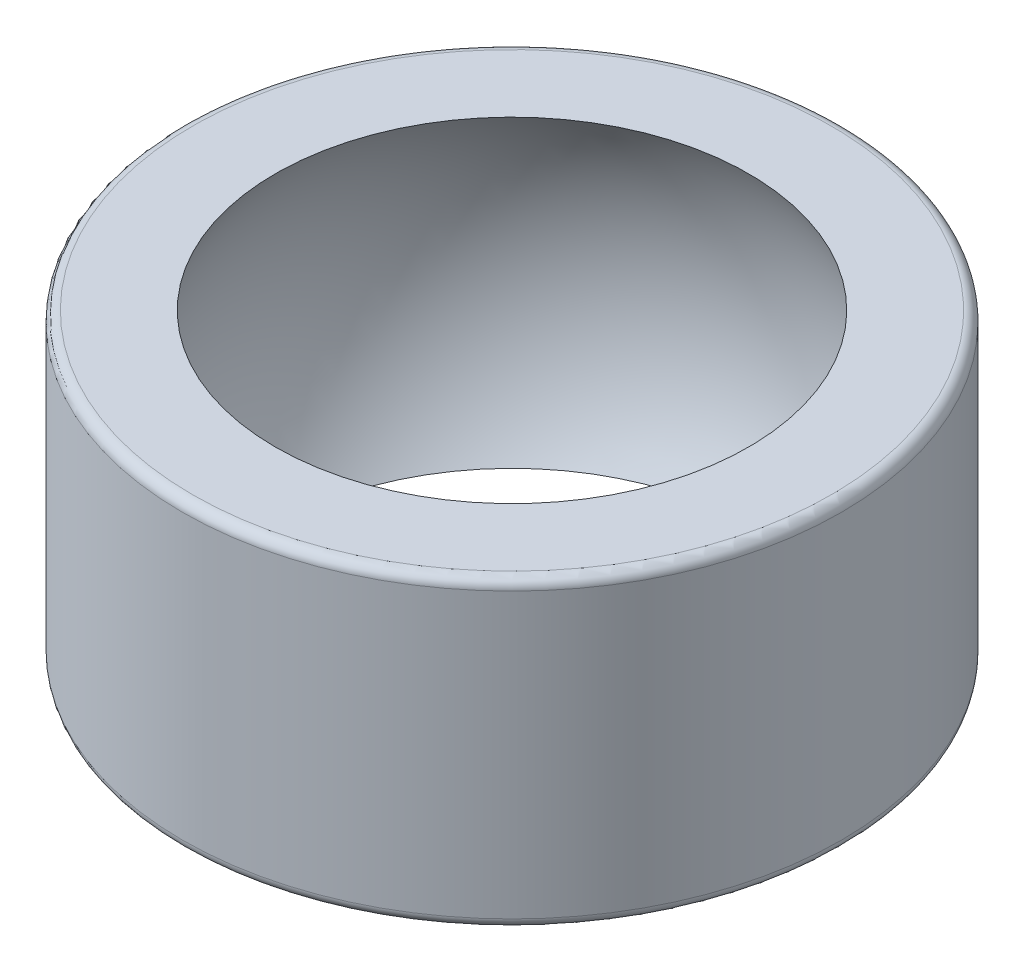
ISO-10303-21;
HEADER;
FILE_DESCRIPTION(('STEP AP214'),'2;1');
FILE_NAME('part.step','',(''),(''),'','','');
FILE_SCHEMA(('AUTOMOTIVE_DESIGN { 1 0 10303 214 1 1 1 1 }'));
ENDSEC;
DATA;
#1=APPLICATION_CONTEXT('core data for automotive mechanical design processes');
#2=APPLICATION_PROTOCOL_DEFINITION('international standard','automotive_design',2000,#1);
#3=PRODUCT_CONTEXT('',#1,'mechanical');
#4=PRODUCT('Part','Part','',(#3));
#5=PRODUCT_RELATED_PRODUCT_CATEGORY('part','',(#4));
#6=PRODUCT_DEFINITION_FORMATION('','',#4);
#7=PRODUCT_DEFINITION_CONTEXT('part definition',#1,'design');
#8=PRODUCT_DEFINITION('design','',#6,#7);
#9=PRODUCT_DEFINITION_SHAPE('','',#8);
#10=(LENGTH_UNIT() NAMED_UNIT(*) SI_UNIT(.MILLI.,.METRE.));
#11=(NAMED_UNIT(*) PLANE_ANGLE_UNIT() SI_UNIT($,.RADIAN.));
#12=(NAMED_UNIT(*) SI_UNIT($,.STERADIAN.) SOLID_ANGLE_UNIT());
#13=UNCERTAINTY_MEASURE_WITH_UNIT(LENGTH_MEASURE(1.E-05),#10,'distance_accuracy_value','');
#14=(GEOMETRIC_REPRESENTATION_CONTEXT(3) GLOBAL_UNCERTAINTY_ASSIGNED_CONTEXT((#13)) GLOBAL_UNIT_ASSIGNED_CONTEXT((#10,
#11,#12)) REPRESENTATION_CONTEXT('',''));
#15=CARTESIAN_POINT('',(0.,0.,0.));
#16=DIRECTION('',(0.,0.,1.));
#17=DIRECTION('',(1.,0.,0.));
#18=AXIS2_PLACEMENT_3D('',#15,#16,#17);
#19=CARTESIAN_POINT('',(0.,3.,0.));
#20=DIRECTION('',(0.,-1.,0.));
#21=DIRECTION('',(0.,0.,-1.));
#22=AXIS2_PLACEMENT_3D('',#19,#20,#21);
#23=CYLINDRICAL_SURFACE('',#22,6.5);
#24=CARTESIAN_POINT('',(0.,-2.8,0.));
#25=DIRECTION('',(0.,1.,0.));
#26=DIRECTION('',(0.,0.,1.));
#27=AXIS2_PLACEMENT_3D('',#24,#25,#26);
#28=CIRCLE('',#27,6.5);
#29=CARTESIAN_POINT('',(0.,-2.8,6.5));
#30=VERTEX_POINT('',#29);
#31=EDGE_CURVE('E42',#30,#30,#28,.T.);
#32=ORIENTED_EDGE('',*,*,#31,.T.);
#33=EDGE_LOOP('',(#32));
#34=FACE_BOUND('',#33,.T.);
#35=CARTESIAN_POINT('',(0.,2.8,0.));
#36=DIRECTION('',(0.,1.,0.));
#37=DIRECTION('',(0.,0.,1.));
#38=AXIS2_PLACEMENT_3D('',#35,#36,#37);
#39=CIRCLE('',#38,6.5);
#40=CARTESIAN_POINT('',(0.,2.8,6.5));
#41=VERTEX_POINT('',#40);
#42=EDGE_CURVE('E46',#41,#41,#39,.F.);
#43=ORIENTED_EDGE('',*,*,#42,.T.);
#44=EDGE_LOOP('',(#43));
#45=FACE_BOUND('',#44,.T.);
#46=ADVANCED_FACE('F31',(#34,#45),#23,.T.);
#47=CARTESIAN_POINT('',(0.,3.,0.));
#48=DIRECTION('',(0.,1.,0.));
#49=DIRECTION('',(0.,0.,1.));
#50=AXIS2_PLACEMENT_3D('',#47,#48,#49);
#51=PLANE('',#50);
#52=CARTESIAN_POINT('',(0.,3.,0.));
#53=DIRECTION('',(0.,1.,0.));
#54=DIRECTION('',(0.,0.,1.));
#55=AXIS2_PLACEMENT_3D('',#52,#53,#54);
#56=CIRCLE('',#55,6.3);
#57=CARTESIAN_POINT('',(0.,3.,6.3));
#58=VERTEX_POINT('',#57);
#59=EDGE_CURVE('E10',#58,#58,#56,.T.);
#60=ORIENTED_EDGE('',*,*,#59,.T.);
#61=EDGE_LOOP('',(#60));
#62=FACE_BOUND('',#61,.T.);
#63=CARTESIAN_POINT('',(0.,3.,0.));
#64=DIRECTION('',(0.,1.,0.));
#65=DIRECTION('',(0.,0.,1.));
#66=AXIS2_PLACEMENT_3D('',#63,#64,#65);
#67=CIRCLE('',#66,4.66931472488202);
#68=CARTESIAN_POINT('',(0.,3.,4.66931472488202));
#69=VERTEX_POINT('',#68);
#70=EDGE_CURVE('E51',#69,#69,#67,.T.);
#71=ORIENTED_EDGE('',*,*,#70,.F.);
#72=EDGE_LOOP('',(#71));
#73=FACE_BOUND('',#72,.T.);
#74=ADVANCED_FACE('F61',(#62,#73),#51,.T.);
#75=CARTESIAN_POINT('',(0.,-3.,0.));
#76=DIRECTION('',(0.,1.,0.));
#77=DIRECTION('',(0.,0.,1.));
#78=AXIS2_PLACEMENT_3D('',#75,#76,#77);
#79=PLANE('',#78);
#80=CARTESIAN_POINT('',(0.,-3.,0.));
#81=DIRECTION('',(0.,1.,0.));
#82=DIRECTION('',(0.,0.,1.));
#83=AXIS2_PLACEMENT_3D('',#80,#81,#82);
#84=CIRCLE('',#83,6.3);
#85=CARTESIAN_POINT('',(0.,-3.,6.3));
#86=VERTEX_POINT('',#85);
#87=EDGE_CURVE('E38',#86,#86,#84,.F.);
#88=ORIENTED_EDGE('',*,*,#87,.T.);
#89=EDGE_LOOP('',(#88));
#90=FACE_BOUND('',#89,.T.);
#91=CARTESIAN_POINT('',(0.,-3.,0.));
#92=DIRECTION('',(0.,1.,0.));
#93=DIRECTION('',(0.,0.,1.));
#94=AXIS2_PLACEMENT_3D('',#91,#92,#93);
#95=CIRCLE('',#94,4.66931472488202);
#96=CARTESIAN_POINT('',(0.,-3.,4.66931472488202));
#97=VERTEX_POINT('',#96);
#98=EDGE_CURVE('E52',#97,#97,#95,.T.);
#99=ORIENTED_EDGE('',*,*,#98,.T.);
#100=EDGE_LOOP('',(#99));
#101=FACE_BOUND('',#100,.T.);
#102=ADVANCED_FACE('F63',(#90,#101),#79,.F.);
#103=CARTESIAN_POINT('',(0.,0.,0.));
#104=DIRECTION('',(0.,-1.,0.));
#105=DIRECTION('',(-1.,0.,0.));
#106=AXIS2_PLACEMENT_3D('',#103,#104,#105);
#107=SPHERICAL_SURFACE('',#106,5.55);
#108=ORIENTED_EDGE('',*,*,#70,.T.);
#109=EDGE_LOOP('',(#108));
#110=FACE_BOUND('',#109,.T.);
#111=ORIENTED_EDGE('',*,*,#98,.F.);
#112=EDGE_LOOP('',(#111));
#113=FACE_BOUND('',#112,.T.);
#114=ADVANCED_FACE('F58',(#110,#113),#107,.F.);
#115=CARTESIAN_POINT('',(0.,-2.8,0.));
#116=DIRECTION('',(0.,1.,0.));
#117=DIRECTION('',(0.,0.,1.));
#118=AXIS2_PLACEMENT_3D('',#115,#116,#117);
#119=TOROIDAL_SURFACE('',#118,6.3,0.2);
#120=ORIENTED_EDGE('',*,*,#87,.F.);
#121=EDGE_LOOP('',(#120));
#122=FACE_BOUND('',#121,.T.);
#123=ORIENTED_EDGE('',*,*,#31,.F.);
#124=EDGE_LOOP('',(#123));
#125=FACE_BOUND('',#124,.T.);
#126=ADVANCED_FACE('F73',(#122,#125),#119,.T.);
#127=CARTESIAN_POINT('',(0.,2.8,0.));
#128=DIRECTION('',(0.,1.,0.));
#129=DIRECTION('',(0.,0.,1.));
#130=AXIS2_PLACEMENT_3D('',#127,#128,#129);
#131=TOROIDAL_SURFACE('',#130,6.3,0.2);
#132=ORIENTED_EDGE('',*,*,#42,.F.);
#133=EDGE_LOOP('',(#132));
#134=FACE_BOUND('',#133,.T.);
#135=ORIENTED_EDGE('',*,*,#59,.F.);
#136=EDGE_LOOP('',(#135));
#137=FACE_BOUND('',#136,.T.);
#138=ADVANCED_FACE('F33',(#134,#137),#131,.T.);
#139=CLOSED_SHELL('',(#46,#74,#102,#114,#126,#138));
#140=MANIFOLD_SOLID_BREP('B2',#139);
#141=ADVANCED_BREP_SHAPE_REPRESENTATION('',(#18,#140),#14);
#142=SHAPE_DEFINITION_REPRESENTATION(#9,#141);
ENDSEC;
END-ISO-10303-21;
